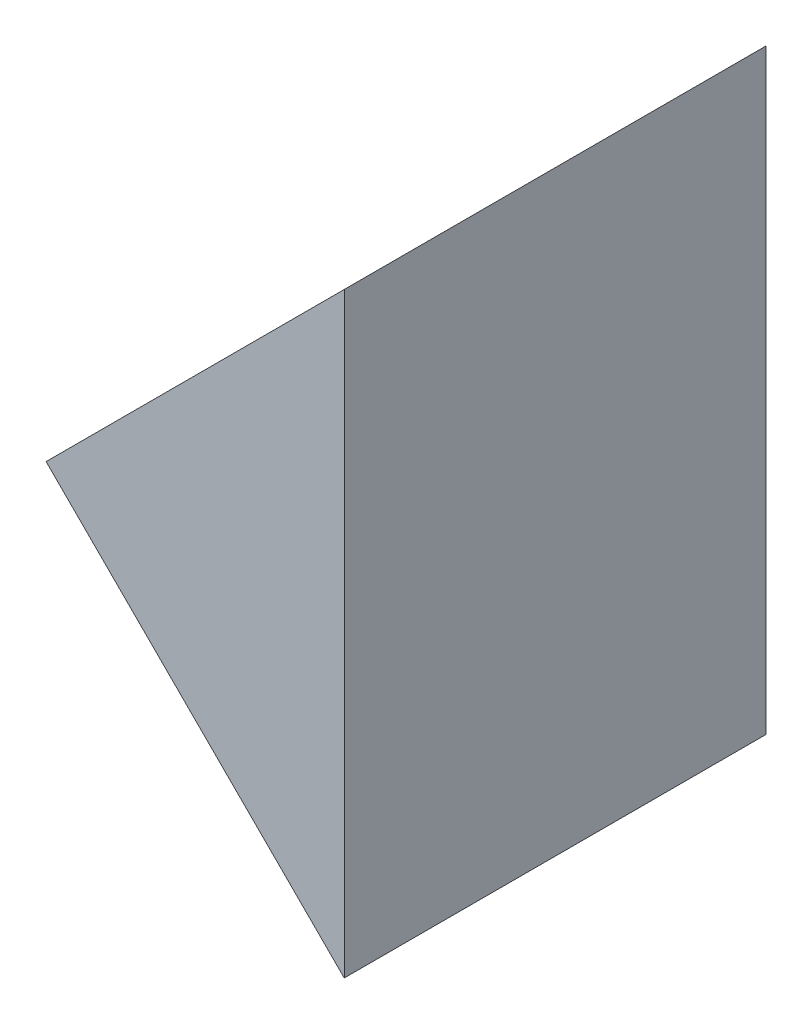
ISO-10303-21;
HEADER;
FILE_DESCRIPTION(('STEP AP214'),'2;1');
FILE_NAME('part.step','',(''),(''),'','','');
FILE_SCHEMA(('AUTOMOTIVE_DESIGN { 1 0 10303 214 1 1 1 1 }'));
ENDSEC;
DATA;
#1=APPLICATION_CONTEXT('core data for automotive mechanical design processes');
#2=APPLICATION_PROTOCOL_DEFINITION('international standard','automotive_design',2000,#1);
#3=PRODUCT_CONTEXT('',#1,'mechanical');
#4=PRODUCT('Part','Part','',(#3));
#5=PRODUCT_RELATED_PRODUCT_CATEGORY('part','',(#4));
#6=PRODUCT_DEFINITION_FORMATION('','',#4);
#7=PRODUCT_DEFINITION_CONTEXT('part definition',#1,'design');
#8=PRODUCT_DEFINITION('design','',#6,#7);
#9=PRODUCT_DEFINITION_SHAPE('','',#8);
#10=(LENGTH_UNIT() NAMED_UNIT(*) SI_UNIT(.MILLI.,.METRE.));
#11=(NAMED_UNIT(*) PLANE_ANGLE_UNIT() SI_UNIT($,.RADIAN.));
#12=(NAMED_UNIT(*) SI_UNIT($,.STERADIAN.) SOLID_ANGLE_UNIT());
#13=UNCERTAINTY_MEASURE_WITH_UNIT(LENGTH_MEASURE(1.E-05),#10,'distance_accuracy_value','');
#14=(GEOMETRIC_REPRESENTATION_CONTEXT(3) GLOBAL_UNCERTAINTY_ASSIGNED_CONTEXT((#13)) GLOBAL_UNIT_ASSIGNED_CONTEXT((#10,
#11,#12)) REPRESENTATION_CONTEXT('',''));
#15=CARTESIAN_POINT('',(0.,0.,0.));
#16=DIRECTION('',(0.,0.,1.));
#17=DIRECTION('',(1.,0.,0.));
#18=AXIS2_PLACEMENT_3D('',#15,#16,#17);
#19=CARTESIAN_POINT('',(554.766699525949,137.756925528341,50.));
#20=DIRECTION('',(0.707106781186548,0.707106781186547,0.));
#21=DIRECTION('',(-0.707106781186547,0.707106781186548,0.));
#22=AXIS2_PLACEMENT_3D('',#19,#20,#21);
#23=PLANE('',#22);
#24=DIRECTION('',(0.707106781186547,-0.707106781186549,0.));
#25=VECTOR('',#24,1.);
#26=CARTESIAN_POINT('',(554.766699525949,137.756925528341,0.));
#27=LINE('',#26,#25);
#28=CARTESIAN_POINT('',(554.766699525949,137.756925528341,0.));
#29=VERTEX_POINT('',#28);
#30=CARTESIAN_POINT('',(590.122038585277,102.401586469013,0.));
#31=VERTEX_POINT('',#30);
#32=EDGE_CURVE('E84',#29,#31,#27,.T.);
#33=ORIENTED_EDGE('',*,*,#32,.T.);
#34=DIRECTION('',(0.,0.,-1.));
#35=VECTOR('',#34,1.);
#36=CARTESIAN_POINT('',(590.122038585277,102.401586469013,50.));
#37=LINE('',#36,#35);
#38=CARTESIAN_POINT('',(590.122038585277,102.401586469013,50.));
#39=VERTEX_POINT('',#38);
#40=EDGE_CURVE('E11',#39,#31,#37,.T.);
#41=ORIENTED_EDGE('',*,*,#40,.F.);
#42=DIRECTION('',(0.707106781186547,-0.707106781186549,0.));
#43=VECTOR('',#42,1.);
#44=CARTESIAN_POINT('',(554.766699525949,137.756925528341,50.));
#45=LINE('',#44,#43);
#46=CARTESIAN_POINT('',(554.766699525949,137.756925528341,50.));
#47=VERTEX_POINT('',#46);
#48=EDGE_CURVE('E77',#47,#39,#45,.T.);
#49=ORIENTED_EDGE('',*,*,#48,.F.);
#50=DIRECTION('',(0.,0.,-1.));
#51=VECTOR('',#50,1.);
#52=CARTESIAN_POINT('',(554.766699525949,137.756925528341,50.));
#53=LINE('',#52,#51);
#54=EDGE_CURVE('E85',#47,#29,#53,.T.);
#55=ORIENTED_EDGE('',*,*,#54,.T.);
#56=EDGE_LOOP('',(#33,#41,#49,#55));
#57=FACE_BOUND('',#56,.T.);
#58=ADVANCED_FACE('F37',(#57),#23,.F.);
#59=CARTESIAN_POINT('',(590.122038585277,102.401586469013,50.));
#60=DIRECTION('',(-1.,0.,0.));
#61=DIRECTION('',(0.,-1.,0.));
#62=AXIS2_PLACEMENT_3D('',#59,#60,#61);
#63=PLANE('',#62);
#64=DIRECTION('',(0.,1.,0.));
#65=VECTOR('',#64,1.);
#66=CARTESIAN_POINT('',(590.122038585277,102.401586469013,0.));
#67=LINE('',#66,#65);
#68=CARTESIAN_POINT('',(590.122038585277,173.112264587668,0.));
#69=VERTEX_POINT('',#68);
#70=EDGE_CURVE('E65',#31,#69,#67,.T.);
#71=ORIENTED_EDGE('',*,*,#70,.T.);
#72=DIRECTION('',(0.,0.,-1.));
#73=VECTOR('',#72,1.);
#74=CARTESIAN_POINT('',(590.122038585277,173.112264587668,50.));
#75=LINE('',#74,#73);
#76=CARTESIAN_POINT('',(590.122038585277,173.112264587668,50.));
#77=VERTEX_POINT('',#76);
#78=EDGE_CURVE('E45',#77,#69,#75,.T.);
#79=ORIENTED_EDGE('',*,*,#78,.F.);
#80=DIRECTION('',(0.,1.,0.));
#81=VECTOR('',#80,1.);
#82=CARTESIAN_POINT('',(590.122038585277,102.401586469013,50.));
#83=LINE('',#82,#81);
#84=EDGE_CURVE('E73',#39,#77,#83,.T.);
#85=ORIENTED_EDGE('',*,*,#84,.F.);
#86=ORIENTED_EDGE('',*,*,#40,.T.);
#87=EDGE_LOOP('',(#71,#79,#85,#86));
#88=FACE_BOUND('',#87,.T.);
#89=ADVANCED_FACE('F74',(#88),#63,.F.);
#90=CARTESIAN_POINT('',(554.766699525949,137.756925528341,50.));
#91=DIRECTION('',(0.707106781186547,-0.707106781186548,0.));
#92=DIRECTION('',(0.707106781186548,0.707106781186547,0.));
#93=AXIS2_PLACEMENT_3D('',#90,#91,#92);
#94=PLANE('',#93);
#95=DIRECTION('',(-0.707106781186548,-0.707106781186547,0.));
#96=VECTOR('',#95,1.);
#97=CARTESIAN_POINT('',(554.766699525949,137.756925528341,0.));
#98=LINE('',#97,#96);
#99=EDGE_CURVE('E70',#69,#29,#98,.T.);
#100=ORIENTED_EDGE('',*,*,#99,.T.);
#101=ORIENTED_EDGE('',*,*,#54,.F.);
#102=DIRECTION('',(-0.707106781186548,-0.707106781186547,0.));
#103=VECTOR('',#102,1.);
#104=CARTESIAN_POINT('',(554.766699525949,137.756925528341,50.));
#105=LINE('',#104,#103);
#106=EDGE_CURVE('E53',#77,#47,#105,.T.);
#107=ORIENTED_EDGE('',*,*,#106,.F.);
#108=ORIENTED_EDGE('',*,*,#78,.T.);
#109=EDGE_LOOP('',(#100,#101,#107,#108));
#110=FACE_BOUND('',#109,.T.);
#111=ADVANCED_FACE('F92',(#110),#94,.F.);
#112=CARTESIAN_POINT('',(0.,0.,50.));
#113=DIRECTION('',(0.,0.,1.));
#114=DIRECTION('',(1.,0.,0.));
#115=AXIS2_PLACEMENT_3D('',#112,#113,#114);
#116=PLANE('',#115);
#117=ORIENTED_EDGE('',*,*,#48,.T.);
#118=ORIENTED_EDGE('',*,*,#84,.T.);
#119=ORIENTED_EDGE('',*,*,#106,.T.);
#120=EDGE_LOOP('',(#117,#118,#119));
#121=FACE_BOUND('',#120,.T.);
#122=ADVANCED_FACE('F80',(#121),#116,.T.);
#123=CARTESIAN_POINT('',(0.,0.,0.));
#124=DIRECTION('',(0.,0.,1.));
#125=DIRECTION('',(1.,0.,0.));
#126=AXIS2_PLACEMENT_3D('',#123,#124,#125);
#127=PLANE('',#126);
#128=ORIENTED_EDGE('',*,*,#32,.F.);
#129=ORIENTED_EDGE('',*,*,#99,.F.);
#130=ORIENTED_EDGE('',*,*,#70,.F.);
#131=EDGE_LOOP('',(#128,#129,#130));
#132=FACE_BOUND('',#131,.T.);
#133=ADVANCED_FACE('F93',(#132),#127,.F.);
#134=CLOSED_SHELL('',(#58,#89,#111,#122,#133));
#135=MANIFOLD_SOLID_BREP('B2',#134);
#136=ADVANCED_BREP_SHAPE_REPRESENTATION('',(#18,#135),#14);
#137=SHAPE_DEFINITION_REPRESENTATION(#9,#136);
ENDSEC;
END-ISO-10303-21;
